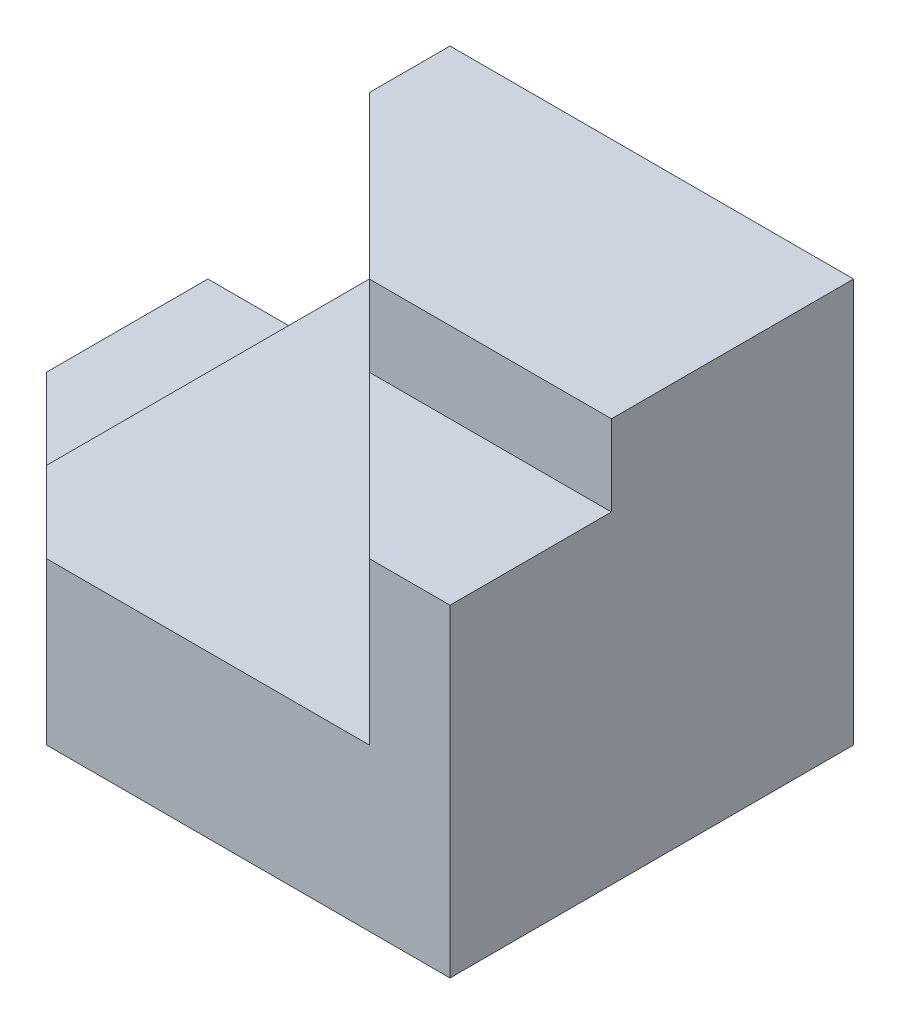
ISO-10303-21;
HEADER;
FILE_DESCRIPTION(('STEP AP214'),'2;1');
FILE_NAME('part.step','',(''),(''),'','','');
FILE_SCHEMA(('AUTOMOTIVE_DESIGN { 1 0 10303 214 1 1 1 1 }'));
ENDSEC;
DATA;
#1=APPLICATION_CONTEXT('core data for automotive mechanical design processes');
#2=APPLICATION_PROTOCOL_DEFINITION('international standard','automotive_design',2000,#1);
#3=PRODUCT_CONTEXT('',#1,'mechanical');
#4=PRODUCT('Part','Part','',(#3));
#5=PRODUCT_RELATED_PRODUCT_CATEGORY('part','',(#4));
#6=PRODUCT_DEFINITION_FORMATION('','',#4);
#7=PRODUCT_DEFINITION_CONTEXT('part definition',#1,'design');
#8=PRODUCT_DEFINITION('design','',#6,#7);
#9=PRODUCT_DEFINITION_SHAPE('','',#8);
#10=(LENGTH_UNIT() NAMED_UNIT(*) SI_UNIT(.MILLI.,.METRE.));
#11=(NAMED_UNIT(*) PLANE_ANGLE_UNIT() SI_UNIT($,.RADIAN.));
#12=(NAMED_UNIT(*) SI_UNIT($,.STERADIAN.) SOLID_ANGLE_UNIT());
#13=UNCERTAINTY_MEASURE_WITH_UNIT(LENGTH_MEASURE(1.E-05),#10,'distance_accuracy_value','');
#14=(GEOMETRIC_REPRESENTATION_CONTEXT(3) GLOBAL_UNCERTAINTY_ASSIGNED_CONTEXT((#13)) GLOBAL_UNIT_ASSIGNED_CONTEXT((#10,
#11,#12)) REPRESENTATION_CONTEXT('',''));
#15=CARTESIAN_POINT('',(0.,0.,0.));
#16=DIRECTION('',(0.,0.,1.));
#17=DIRECTION('',(1.,0.,0.));
#18=AXIS2_PLACEMENT_3D('',#15,#16,#17);
#19=CARTESIAN_POINT('',(0.,40.,0.));
#20=DIRECTION('',(0.,-1.,0.));
#21=DIRECTION('',(0.,0.,-1.));
#22=AXIS2_PLACEMENT_3D('',#19,#20,#21);
#23=PLANE('',#22);
#24=DIRECTION('',(1.,0.,0.));
#25=VECTOR('',#24,1.);
#26=CARTESIAN_POINT('',(80.,40.,-20.));
#27=LINE('',#26,#25);
#28=CARTESIAN_POINT('',(50.,40.,-20.));
#29=VERTEX_POINT('',#28);
#30=CARTESIAN_POINT('',(80.,40.,-20.));
#31=VERTEX_POINT('',#30);
#32=EDGE_CURVE('E50',#29,#31,#27,.T.);
#33=ORIENTED_EDGE('',*,*,#32,.F.);
#34=DIRECTION('',(0.707106781186548,0.,0.707106781186547));
#35=VECTOR('',#34,1.);
#36=CARTESIAN_POINT('',(70.,40.,0.));
#37=LINE('',#36,#35);
#38=CARTESIAN_POINT('',(70.,40.,0.));
#39=VERTEX_POINT('',#38);
#40=EDGE_CURVE('E179',#29,#39,#37,.T.);
#41=ORIENTED_EDGE('',*,*,#40,.T.);
#42=DIRECTION('',(1.,0.,0.));
#43=VECTOR('',#42,1.);
#44=CARTESIAN_POINT('',(80.,40.,0.));
#45=LINE('',#44,#43);
#46=CARTESIAN_POINT('',(80.,40.,0.));
#47=VERTEX_POINT('',#46);
#48=EDGE_CURVE('E303',#39,#47,#45,.T.);
#49=ORIENTED_EDGE('',*,*,#48,.T.);
#50=DIRECTION('',(0.,0.,-1.));
#51=VECTOR('',#50,1.);
#52=CARTESIAN_POINT('',(80.,40.,-50.));
#53=LINE('',#52,#51);
#54=EDGE_CURVE('E165',#47,#31,#53,.T.);
#55=ORIENTED_EDGE('',*,*,#54,.T.);
#56=EDGE_LOOP('',(#33,#41,#49,#55));
#57=FACE_BOUND('',#56,.T.);
#58=ADVANCED_FACE('F33',(#57),#23,.F.);
#59=CARTESIAN_POINT('',(0.,20.,0.));
#60=DIRECTION('',(0.,-1.,0.));
#61=DIRECTION('',(0.,0.,-1.));
#62=AXIS2_PLACEMENT_3D('',#59,#60,#61);
#63=PLANE('',#62);
#64=DIRECTION('',(0.707106781186548,0.,0.707106781186547));
#65=VECTOR('',#64,1.);
#66=CARTESIAN_POINT('',(70.,20.,0.));
#67=LINE('',#66,#65);
#68=CARTESIAN_POINT('',(30.,20.,-40.));
#69=VERTEX_POINT('',#68);
#70=CARTESIAN_POINT('',(70.,20.,0.));
#71=VERTEX_POINT('',#70);
#72=EDGE_CURVE('E177',#69,#71,#67,.T.);
#73=ORIENTED_EDGE('',*,*,#72,.F.);
#74=DIRECTION('',(0.,0.,1.));
#75=VECTOR('',#74,1.);
#76=CARTESIAN_POINT('',(30.,20.,-40.));
#77=LINE('',#76,#75);
#78=CARTESIAN_POINT('',(30.,20.,-50.));
#79=VERTEX_POINT('',#78);
#80=EDGE_CURVE('E173',#79,#69,#77,.T.);
#81=ORIENTED_EDGE('',*,*,#80,.F.);
#82=DIRECTION('',(-1.,0.,0.));
#83=VECTOR('',#82,1.);
#84=CARTESIAN_POINT('',(20.,20.,-50.));
#85=LINE('',#84,#83);
#86=CARTESIAN_POINT('',(20.,20.,-50.));
#87=VERTEX_POINT('',#86);
#88=EDGE_CURVE('E133',#79,#87,#85,.T.);
#89=ORIENTED_EDGE('',*,*,#88,.T.);
#90=DIRECTION('',(0.,0.,1.));
#91=VECTOR('',#90,1.);
#92=CARTESIAN_POINT('',(20.,20.,-10.));
#93=LINE('',#92,#91);
#94=CARTESIAN_POINT('',(20.,20.,-10.));
#95=VERTEX_POINT('',#94);
#96=EDGE_CURVE('E198',#87,#95,#93,.T.);
#97=ORIENTED_EDGE('',*,*,#96,.T.);
#98=DIRECTION('',(0.707106781186548,0.,0.707106781186548));
#99=VECTOR('',#98,1.);
#100=CARTESIAN_POINT('',(30.,20.,0.));
#101=LINE('',#100,#99);
#102=CARTESIAN_POINT('',(30.,20.,0.));
#103=VERTEX_POINT('',#102);
#104=EDGE_CURVE('E268',#95,#103,#101,.T.);
#105=ORIENTED_EDGE('',*,*,#104,.T.);
#106=DIRECTION('',(1.,0.,0.));
#107=VECTOR('',#106,1.);
#108=CARTESIAN_POINT('',(80.,20.,0.));
#109=LINE('',#108,#107);
#110=EDGE_CURVE('E58',#103,#71,#109,.T.);
#111=ORIENTED_EDGE('',*,*,#110,.T.);
#112=EDGE_LOOP('',(#73,#81,#89,#97,#105,#111));
#113=FACE_BOUND('',#112,.T.);
#114=ADVANCED_FACE('F271',(#113),#63,.F.);
#115=CARTESIAN_POINT('',(0.,10.,0.));
#116=DIRECTION('',(0.,-1.,0.));
#117=DIRECTION('',(0.,0.,-1.));
#118=AXIS2_PLACEMENT_3D('',#115,#116,#117);
#119=PLANE('',#118);
#120=DIRECTION('',(0.,0.,1.));
#121=VECTOR('',#120,1.);
#122=CARTESIAN_POINT('',(20.,10.,-10.));
#123=LINE('',#122,#121);
#124=CARTESIAN_POINT('',(20.,10.,-50.));
#125=VERTEX_POINT('',#124);
#126=CARTESIAN_POINT('',(20.,10.,-10.));
#127=VERTEX_POINT('',#126);
#128=EDGE_CURVE('E136',#125,#127,#123,.T.);
#129=ORIENTED_EDGE('',*,*,#128,.F.);
#130=DIRECTION('',(-1.,0.,0.));
#131=VECTOR('',#130,1.);
#132=CARTESIAN_POINT('',(0.,10.,-50.));
#133=LINE('',#132,#131);
#134=CARTESIAN_POINT('',(0.,10.,-50.));
#135=VERTEX_POINT('',#134);
#136=EDGE_CURVE('E215',#125,#135,#133,.T.);
#137=ORIENTED_EDGE('',*,*,#136,.T.);
#138=DIRECTION('',(0.,0.,1.));
#139=VECTOR('',#138,1.);
#140=CARTESIAN_POINT('',(0.,10.,0.));
#141=LINE('',#140,#139);
#142=CARTESIAN_POINT('',(0.,10.,-30.));
#143=VERTEX_POINT('',#142);
#144=EDGE_CURVE('E236',#135,#143,#141,.T.);
#145=ORIENTED_EDGE('',*,*,#144,.T.);
#146=DIRECTION('',(-0.707106781186547,0.,-0.707106781186547));
#147=VECTOR('',#146,1.);
#148=CARTESIAN_POINT('',(0.,10.,-30.));
#149=LINE('',#148,#147);
#150=EDGE_CURVE('E206',#127,#143,#149,.T.);
#151=ORIENTED_EDGE('',*,*,#150,.F.);
#152=EDGE_LOOP('',(#129,#137,#145,#151));
#153=FACE_BOUND('',#152,.T.);
#154=ADVANCED_FACE('F254',(#153),#119,.F.);
#155=CARTESIAN_POINT('',(0.,10.,0.));
#156=DIRECTION('',(1.,0.,0.));
#157=DIRECTION('',(0.,0.,-1.));
#158=AXIS2_PLACEMENT_3D('',#155,#156,#157);
#159=PLANE('',#158);
#160=DIRECTION('',(0.,0.,1.));
#161=VECTOR('',#160,1.);
#162=CARTESIAN_POINT('',(0.,0.,0.));
#163=LINE('',#162,#161);
#164=CARTESIAN_POINT('',(0.,0.,-50.));
#165=VERTEX_POINT('',#164);
#166=CARTESIAN_POINT('',(0.,0.,-30.));
#167=VERTEX_POINT('',#166);
#168=EDGE_CURVE('E241',#165,#167,#163,.T.);
#169=ORIENTED_EDGE('',*,*,#168,.T.);
#170=DIRECTION('',(0.,1.,0.));
#171=VECTOR('',#170,1.);
#172=CARTESIAN_POINT('',(0.,0.,-30.));
#173=LINE('',#172,#171);
#174=EDGE_CURVE('E227',#167,#143,#173,.T.);
#175=ORIENTED_EDGE('',*,*,#174,.T.);
#176=ORIENTED_EDGE('',*,*,#144,.F.);
#177=DIRECTION('',(0.,-1.,0.));
#178=VECTOR('',#177,1.);
#179=CARTESIAN_POINT('',(0.,10.,-50.));
#180=LINE('',#179,#178);
#181=EDGE_CURVE('E231',#135,#165,#180,.T.);
#182=ORIENTED_EDGE('',*,*,#181,.T.);
#183=EDGE_LOOP('',(#169,#175,#176,#182));
#184=FACE_BOUND('',#183,.T.);
#185=ADVANCED_FACE('F35',(#184),#159,.F.);
#186=CARTESIAN_POINT('',(0.,10.,0.));
#187=DIRECTION('',(0.,0.,-1.));
#188=DIRECTION('',(-1.,0.,0.));
#189=AXIS2_PLACEMENT_3D('',#186,#187,#188);
#190=PLANE('',#189);
#191=DIRECTION('',(0.,-1.,0.));
#192=VECTOR('',#191,1.);
#193=CARTESIAN_POINT('',(80.,10.,0.));
#194=LINE('',#193,#192);
#195=CARTESIAN_POINT('',(80.,0.,0.));
#196=VERTEX_POINT('',#195);
#197=EDGE_CURVE('E11',#47,#196,#194,.T.);
#198=ORIENTED_EDGE('',*,*,#197,.F.);
#199=ORIENTED_EDGE('',*,*,#48,.F.);
#200=DIRECTION('',(0.,-1.,0.));
#201=VECTOR('',#200,1.);
#202=CARTESIAN_POINT('',(70.,40.,0.));
#203=LINE('',#202,#201);
#204=EDGE_CURVE('E190',#39,#71,#203,.T.);
#205=ORIENTED_EDGE('',*,*,#204,.T.);
#206=ORIENTED_EDGE('',*,*,#110,.F.);
#207=DIRECTION('',(0.,1.,0.));
#208=VECTOR('',#207,1.);
#209=CARTESIAN_POINT('',(30.,0.,0.));
#210=LINE('',#209,#208);
#211=CARTESIAN_POINT('',(30.,0.,0.));
#212=VERTEX_POINT('',#211);
#213=EDGE_CURVE('E224',#212,#103,#210,.T.);
#214=ORIENTED_EDGE('',*,*,#213,.F.);
#215=DIRECTION('',(1.,0.,0.));
#216=VECTOR('',#215,1.);
#217=CARTESIAN_POINT('',(0.,0.,0.));
#218=LINE('',#217,#216);
#219=EDGE_CURVE('E239',#212,#196,#218,.T.);
#220=ORIENTED_EDGE('',*,*,#219,.T.);
#221=EDGE_LOOP('',(#198,#199,#205,#206,#214,#220));
#222=FACE_BOUND('',#221,.T.);
#223=ADVANCED_FACE('F264',(#222),#190,.F.);
#224=CARTESIAN_POINT('',(80.,10.,0.));
#225=DIRECTION('',(-1.,0.,0.));
#226=DIRECTION('',(0.,0.,1.));
#227=AXIS2_PLACEMENT_3D('',#224,#225,#226);
#228=PLANE('',#227);
#229=DIRECTION('',(0.,0.,-1.));
#230=VECTOR('',#229,1.);
#231=CARTESIAN_POINT('',(80.,0.,0.));
#232=LINE('',#231,#230);
#233=CARTESIAN_POINT('',(80.,0.,-50.));
#234=VERTEX_POINT('',#233);
#235=EDGE_CURVE('E237',#196,#234,#232,.T.);
#236=ORIENTED_EDGE('',*,*,#235,.T.);
#237=DIRECTION('',(0.,-1.,0.));
#238=VECTOR('',#237,1.);
#239=CARTESIAN_POINT('',(80.,10.,-50.));
#240=LINE('',#239,#238);
#241=CARTESIAN_POINT('',(80.,50.,-50.));
#242=VERTEX_POINT('',#241);
#243=EDGE_CURVE('E42',#242,#234,#240,.T.);
#244=ORIENTED_EDGE('',*,*,#243,.F.);
#245=DIRECTION('',(0.,0.,-1.));
#246=VECTOR('',#245,1.);
#247=CARTESIAN_POINT('',(80.,50.,-50.));
#248=LINE('',#247,#246);
#249=CARTESIAN_POINT('',(80.,50.,-20.));
#250=VERTEX_POINT('',#249);
#251=EDGE_CURVE('E150',#250,#242,#248,.T.);
#252=ORIENTED_EDGE('',*,*,#251,.F.);
#253=DIRECTION('',(0.,-1.,0.));
#254=VECTOR('',#253,1.);
#255=CARTESIAN_POINT('',(80.,50.,-20.));
#256=LINE('',#255,#254);
#257=EDGE_CURVE('E158',#250,#31,#256,.T.);
#258=ORIENTED_EDGE('',*,*,#257,.T.);
#259=ORIENTED_EDGE('',*,*,#54,.F.);
#260=ORIENTED_EDGE('',*,*,#197,.T.);
#261=EDGE_LOOP('',(#236,#244,#252,#258,#259,#260));
#262=FACE_BOUND('',#261,.T.);
#263=ADVANCED_FACE('F301',(#262),#228,.F.);
#264=CARTESIAN_POINT('',(0.,10.,-50.));
#265=DIRECTION('',(0.,0.,1.));
#266=DIRECTION('',(1.,0.,0.));
#267=AXIS2_PLACEMENT_3D('',#264,#265,#266);
#268=PLANE('',#267);
#269=DIRECTION('',(-1.,0.,0.));
#270=VECTOR('',#269,1.);
#271=CARTESIAN_POINT('',(0.,0.,-50.));
#272=LINE('',#271,#270);
#273=EDGE_CURVE('E234',#234,#165,#272,.T.);
#274=ORIENTED_EDGE('',*,*,#273,.T.);
#275=ORIENTED_EDGE('',*,*,#181,.F.);
#276=ORIENTED_EDGE('',*,*,#136,.F.);
#277=DIRECTION('',(0.,-1.,0.));
#278=VECTOR('',#277,1.);
#279=CARTESIAN_POINT('',(20.,20.,-50.));
#280=LINE('',#279,#278);
#281=EDGE_CURVE('E203',#87,#125,#280,.T.);
#282=ORIENTED_EDGE('',*,*,#281,.F.);
#283=ORIENTED_EDGE('',*,*,#88,.F.);
#284=DIRECTION('',(0.,-1.,0.));
#285=VECTOR('',#284,1.);
#286=CARTESIAN_POINT('',(30.,40.,-50.));
#287=LINE('',#286,#285);
#288=CARTESIAN_POINT('',(30.,50.,-50.));
#289=VERTEX_POINT('',#288);
#290=EDGE_CURVE('E126',#289,#79,#287,.T.);
#291=ORIENTED_EDGE('',*,*,#290,.F.);
#292=DIRECTION('',(-1.,0.,0.));
#293=VECTOR('',#292,1.);
#294=CARTESIAN_POINT('',(30.,50.,-50.));
#295=LINE('',#294,#293);
#296=EDGE_CURVE('E131',#242,#289,#295,.T.);
#297=ORIENTED_EDGE('',*,*,#296,.F.);
#298=ORIENTED_EDGE('',*,*,#243,.T.);
#299=EDGE_LOOP('',(#274,#275,#276,#282,#283,#291,#297,#298));
#300=FACE_BOUND('',#299,.T.);
#301=ADVANCED_FACE('F128',(#300),#268,.F.);
#302=CARTESIAN_POINT('',(0.,0.,0.));
#303=DIRECTION('',(0.,-1.,0.));
#304=DIRECTION('',(0.,0.,-1.));
#305=AXIS2_PLACEMENT_3D('',#302,#303,#304);
#306=PLANE('',#305);
#307=DIRECTION('',(-0.707106781186547,0.,-0.707106781186547));
#308=VECTOR('',#307,1.);
#309=CARTESIAN_POINT('',(0.,0.,-30.));
#310=LINE('',#309,#308);
#311=EDGE_CURVE('E221',#212,#167,#310,.T.);
#312=ORIENTED_EDGE('',*,*,#311,.T.);
#313=ORIENTED_EDGE('',*,*,#168,.F.);
#314=ORIENTED_EDGE('',*,*,#273,.F.);
#315=ORIENTED_EDGE('',*,*,#235,.F.);
#316=ORIENTED_EDGE('',*,*,#219,.F.);
#317=EDGE_LOOP('',(#312,#313,#314,#315,#316));
#318=FACE_BOUND('',#317,.T.);
#319=ADVANCED_FACE('F259',(#318),#306,.T.);
#320=CARTESIAN_POINT('',(0.,0.,-30.));
#321=DIRECTION('',(0.707106781186548,0.,-0.707106781186548));
#322=DIRECTION('',(-0.707106781186548,0.,-0.707106781186548));
#323=AXIS2_PLACEMENT_3D('',#320,#321,#322);
#324=PLANE('',#323);
#325=ORIENTED_EDGE('',*,*,#213,.T.);
#326=ORIENTED_EDGE('',*,*,#104,.F.);
#327=DIRECTION('',(0.,-1.,0.));
#328=VECTOR('',#327,1.);
#329=CARTESIAN_POINT('',(20.,20.,-10.));
#330=LINE('',#329,#328);
#331=EDGE_CURVE('E207',#95,#127,#330,.T.);
#332=ORIENTED_EDGE('',*,*,#331,.T.);
#333=ORIENTED_EDGE('',*,*,#150,.T.);
#334=ORIENTED_EDGE('',*,*,#174,.F.);
#335=ORIENTED_EDGE('',*,*,#311,.F.);
#336=EDGE_LOOP('',(#325,#326,#332,#333,#334,#335));
#337=FACE_BOUND('',#336,.T.);
#338=ADVANCED_FACE('F262',(#337),#324,.F.);
#339=CARTESIAN_POINT('',(20.,20.,-10.));
#340=DIRECTION('',(1.,0.,0.));
#341=DIRECTION('',(0.,0.,-1.));
#342=AXIS2_PLACEMENT_3D('',#339,#340,#341);
#343=PLANE('',#342);
#344=ORIENTED_EDGE('',*,*,#128,.T.);
#345=ORIENTED_EDGE('',*,*,#331,.F.);
#346=ORIENTED_EDGE('',*,*,#96,.F.);
#347=ORIENTED_EDGE('',*,*,#281,.T.);
#348=EDGE_LOOP('',(#344,#345,#346,#347));
#349=FACE_BOUND('',#348,.T.);
#350=ADVANCED_FACE('F273',(#349),#343,.F.);
#351=CARTESIAN_POINT('',(30.,40.,-40.));
#352=DIRECTION('',(1.,0.,0.));
#353=DIRECTION('',(0.,0.,-1.));
#354=AXIS2_PLACEMENT_3D('',#351,#352,#353);
#355=PLANE('',#354);
#356=ORIENTED_EDGE('',*,*,#80,.T.);
#357=DIRECTION('',(0.,-1.,0.));
#358=VECTOR('',#357,1.);
#359=CARTESIAN_POINT('',(30.,40.,-40.));
#360=LINE('',#359,#358);
#361=CARTESIAN_POINT('',(30.,50.,-40.));
#362=VERTEX_POINT('',#361);
#363=EDGE_CURVE('E137',#362,#69,#360,.T.);
#364=ORIENTED_EDGE('',*,*,#363,.F.);
#365=DIRECTION('',(0.,0.,1.));
#366=VECTOR('',#365,1.);
#367=CARTESIAN_POINT('',(30.,50.,-40.));
#368=LINE('',#367,#366);
#369=EDGE_CURVE('E140',#289,#362,#368,.T.);
#370=ORIENTED_EDGE('',*,*,#369,.F.);
#371=ORIENTED_EDGE('',*,*,#290,.T.);
#372=EDGE_LOOP('',(#356,#364,#370,#371));
#373=FACE_BOUND('',#372,.T.);
#374=ADVANCED_FACE('F141',(#373),#355,.F.);
#375=CARTESIAN_POINT('',(70.,40.,0.));
#376=DIRECTION('',(0.707106781186547,0.,-0.707106781186548));
#377=DIRECTION('',(-0.707106781186548,0.,-0.707106781186547));
#378=AXIS2_PLACEMENT_3D('',#375,#376,#377);
#379=PLANE('',#378);
#380=ORIENTED_EDGE('',*,*,#72,.T.);
#381=ORIENTED_EDGE('',*,*,#204,.F.);
#382=ORIENTED_EDGE('',*,*,#40,.F.);
#383=DIRECTION('',(0.,-1.,0.));
#384=VECTOR('',#383,1.);
#385=CARTESIAN_POINT('',(50.,50.,-20.));
#386=LINE('',#385,#384);
#387=CARTESIAN_POINT('',(50.,50.,-20.));
#388=VERTEX_POINT('',#387);
#389=EDGE_CURVE('E170',#388,#29,#386,.T.);
#390=ORIENTED_EDGE('',*,*,#389,.F.);
#391=DIRECTION('',(0.707106781186548,0.,0.707106781186547));
#392=VECTOR('',#391,1.);
#393=CARTESIAN_POINT('',(50.,50.,-20.));
#394=LINE('',#393,#392);
#395=EDGE_CURVE('E145',#362,#388,#394,.T.);
#396=ORIENTED_EDGE('',*,*,#395,.F.);
#397=ORIENTED_EDGE('',*,*,#363,.T.);
#398=EDGE_LOOP('',(#380,#381,#382,#390,#396,#397));
#399=FACE_BOUND('',#398,.T.);
#400=ADVANCED_FACE('F280',(#399),#379,.F.);
#401=CARTESIAN_POINT('',(80.,50.,-20.));
#402=DIRECTION('',(0.,0.,-1.));
#403=DIRECTION('',(-1.,0.,0.));
#404=AXIS2_PLACEMENT_3D('',#401,#402,#403);
#405=PLANE('',#404);
#406=ORIENTED_EDGE('',*,*,#32,.T.);
#407=ORIENTED_EDGE('',*,*,#257,.F.);
#408=DIRECTION('',(1.,0.,0.));
#409=VECTOR('',#408,1.);
#410=CARTESIAN_POINT('',(80.,50.,-20.));
#411=LINE('',#410,#409);
#412=EDGE_CURVE('E155',#388,#250,#411,.T.);
#413=ORIENTED_EDGE('',*,*,#412,.F.);
#414=ORIENTED_EDGE('',*,*,#389,.T.);
#415=EDGE_LOOP('',(#406,#407,#413,#414));
#416=FACE_BOUND('',#415,.T.);
#417=ADVANCED_FACE('F291',(#416),#405,.F.);
#418=CARTESIAN_POINT('',(0.,50.,0.));
#419=DIRECTION('',(0.,-1.,0.));
#420=DIRECTION('',(0.,0.,-1.));
#421=AXIS2_PLACEMENT_3D('',#418,#419,#420);
#422=PLANE('',#421);
#423=ORIENTED_EDGE('',*,*,#296,.T.);
#424=ORIENTED_EDGE('',*,*,#369,.T.);
#425=ORIENTED_EDGE('',*,*,#395,.T.);
#426=ORIENTED_EDGE('',*,*,#412,.T.);
#427=ORIENTED_EDGE('',*,*,#251,.T.);
#428=EDGE_LOOP('',(#423,#424,#425,#426,#427));
#429=FACE_BOUND('',#428,.T.);
#430=ADVANCED_FACE('F148',(#429),#422,.F.);
#431=CLOSED_SHELL('',(#58,#114,#154,#185,#223,#263,#301,#319,#338,#350,#374,#400,#417,#430));
#432=MANIFOLD_SOLID_BREP('B2',#431);
#433=ADVANCED_BREP_SHAPE_REPRESENTATION('',(#18,#432),#14);
#434=SHAPE_DEFINITION_REPRESENTATION(#9,#433);
ENDSEC;
END-ISO-10303-21;
